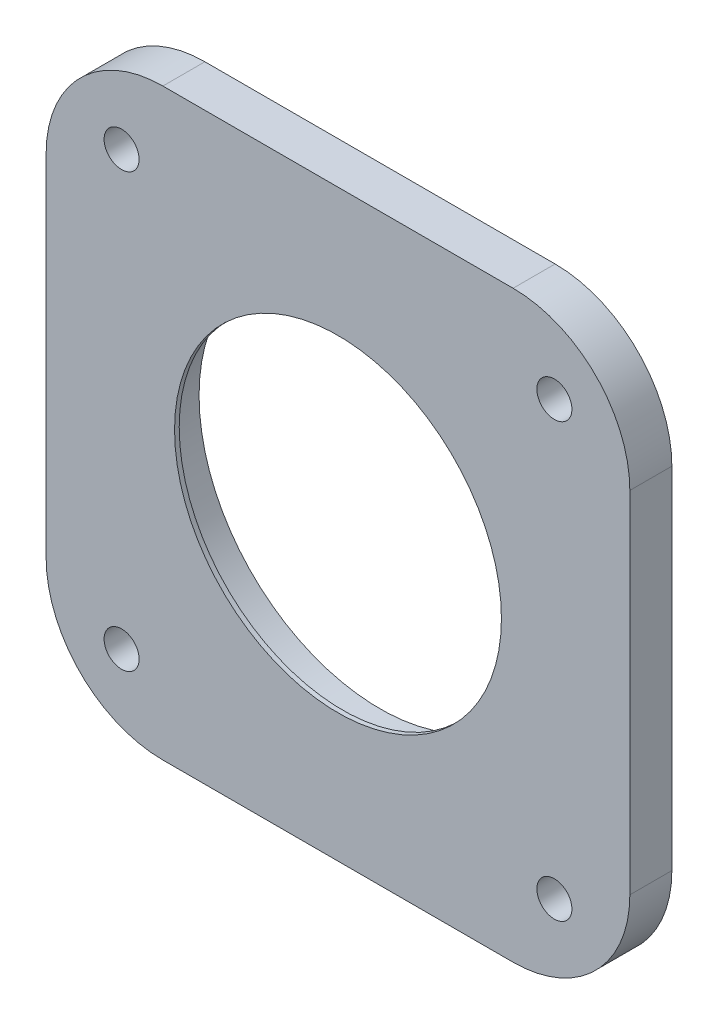
ISO-10303-21;
HEADER;
FILE_DESCRIPTION(('STEP AP214'),'2;1');
FILE_NAME('part.step','',(''),(''),'','','');
FILE_SCHEMA(('AUTOMOTIVE_DESIGN { 1 0 10303 214 1 1 1 1 }'));
ENDSEC;
DATA;
#1=APPLICATION_CONTEXT('core data for automotive mechanical design processes');
#2=APPLICATION_PROTOCOL_DEFINITION('international standard','automotive_design',2000,#1);
#3=PRODUCT_CONTEXT('',#1,'mechanical');
#4=PRODUCT('Part','Part','',(#3));
#5=PRODUCT_RELATED_PRODUCT_CATEGORY('part','',(#4));
#6=PRODUCT_DEFINITION_FORMATION('','',#4);
#7=PRODUCT_DEFINITION_CONTEXT('part definition',#1,'design');
#8=PRODUCT_DEFINITION('design','',#6,#7);
#9=PRODUCT_DEFINITION_SHAPE('','',#8);
#10=(LENGTH_UNIT() NAMED_UNIT(*) SI_UNIT(.MILLI.,.METRE.));
#11=(NAMED_UNIT(*) PLANE_ANGLE_UNIT() SI_UNIT($,.RADIAN.));
#12=(NAMED_UNIT(*) SI_UNIT($,.STERADIAN.) SOLID_ANGLE_UNIT());
#13=UNCERTAINTY_MEASURE_WITH_UNIT(LENGTH_MEASURE(1.E-05),#10,'distance_accuracy_value','');
#14=(GEOMETRIC_REPRESENTATION_CONTEXT(3) GLOBAL_UNCERTAINTY_ASSIGNED_CONTEXT((#13)) GLOBAL_UNIT_ASSIGNED_CONTEXT((#10,
#11,#12)) REPRESENTATION_CONTEXT('',''));
#15=CARTESIAN_POINT('',(0.,0.,0.));
#16=DIRECTION('',(0.,0.,1.));
#17=DIRECTION('',(1.,0.,0.));
#18=AXIS2_PLACEMENT_3D('',#15,#16,#17);
#19=CARTESIAN_POINT('',(0.,0.,4.572));
#20=DIRECTION('',(0.,0.,-1.));
#21=DIRECTION('',(-1.,0.,0.));
#22=AXIS2_PLACEMENT_3D('',#19,#20,#21);
#23=CYLINDRICAL_SURFACE('',#22,19.685);
#24=CARTESIAN_POINT('',(0.,0.,0.));
#25=DIRECTION('',(0.,0.,1.));
#26=DIRECTION('',(1.,0.,0.));
#27=AXIS2_PLACEMENT_3D('',#24,#25,#26);
#28=CIRCLE('',#27,19.685);
#29=CARTESIAN_POINT('',(19.685,0.,0.));
#30=VERTEX_POINT('',#29);
#31=EDGE_CURVE('E153',#30,#30,#28,.T.);
#32=ORIENTED_EDGE('',*,*,#31,.F.);
#33=EDGE_LOOP('',(#32));
#34=FACE_BOUND('',#33,.T.);
#35=CARTESIAN_POINT('',(0.,0.,4.064));
#36=DIRECTION('',(0.,0.,1.));
#37=DIRECTION('',(1.,0.,0.));
#38=AXIS2_PLACEMENT_3D('',#35,#36,#37);
#39=CIRCLE('',#38,19.685);
#40=CARTESIAN_POINT('',(19.685,0.,4.064));
#41=VERTEX_POINT('',#40);
#42=EDGE_CURVE('E248',#41,#41,#39,.T.);
#43=ORIENTED_EDGE('',*,*,#42,.T.);
#44=EDGE_LOOP('',(#43));
#45=FACE_BOUND('',#44,.T.);
#46=ADVANCED_FACE('F45',(#34,#45),#23,.F.);
#47=CARTESIAN_POINT('',(-19.05,-19.05,4.572));
#48=DIRECTION('',(0.,0.,-1.));
#49=DIRECTION('',(-1.,0.,0.));
#50=AXIS2_PLACEMENT_3D('',#47,#48,#49);
#51=PLANE('',#50);
#52=CARTESIAN_POINT('',(-19.05,-19.05,4.572));
#53=DIRECTION('',(0.,0.,1.));
#54=DIRECTION('',(-1.,0.,0.));
#55=AXIS2_PLACEMENT_3D('',#52,#53,#54);
#56=CIRCLE('',#55,12.7);
#57=CARTESIAN_POINT('',(-31.75,-19.0499999999999,4.572));
#58=VERTEX_POINT('',#57);
#59=CARTESIAN_POINT('',(-19.0499999999999,-31.75,4.572));
#60=VERTEX_POINT('',#59);
#61=EDGE_CURVE('E171',#58,#60,#56,.T.);
#62=ORIENTED_EDGE('',*,*,#61,.T.);
#63=DIRECTION('',(1.,0.,0.));
#64=VECTOR('',#63,1.);
#65=CARTESIAN_POINT('',(-19.0499999999999,-31.75,4.572));
#66=LINE('',#65,#64);
#67=CARTESIAN_POINT('',(19.0499999999999,-31.75,4.572));
#68=VERTEX_POINT('',#67);
#69=EDGE_CURVE('E106',#60,#68,#66,.T.);
#70=ORIENTED_EDGE('',*,*,#69,.T.);
#71=CARTESIAN_POINT('',(19.05,-19.05,4.572));
#72=DIRECTION('',(0.,0.,1.));
#73=DIRECTION('',(1.,0.,0.));
#74=AXIS2_PLACEMENT_3D('',#71,#72,#73);
#75=CIRCLE('',#74,12.7);
#76=CARTESIAN_POINT('',(31.75,-19.05,4.572));
#77=VERTEX_POINT('',#76);
#78=EDGE_CURVE('E192',#68,#77,#75,.T.);
#79=ORIENTED_EDGE('',*,*,#78,.T.);
#80=DIRECTION('',(0.,1.,0.));
#81=VECTOR('',#80,1.);
#82=CARTESIAN_POINT('',(31.75,-19.0499999999999,4.572));
#83=LINE('',#82,#81);
#84=CARTESIAN_POINT('',(31.75,19.0499999999999,4.572));
#85=VERTEX_POINT('',#84);
#86=EDGE_CURVE('E206',#77,#85,#83,.T.);
#87=ORIENTED_EDGE('',*,*,#86,.T.);
#88=CARTESIAN_POINT('',(19.05,19.05,4.572));
#89=DIRECTION('',(0.,0.,1.));
#90=DIRECTION('',(-1.,0.,0.));
#91=AXIS2_PLACEMENT_3D('',#88,#89,#90);
#92=CIRCLE('',#91,12.7);
#93=CARTESIAN_POINT('',(19.0499999999999,31.75,4.572));
#94=VERTEX_POINT('',#93);
#95=EDGE_CURVE('E126',#85,#94,#92,.T.);
#96=ORIENTED_EDGE('',*,*,#95,.T.);
#97=DIRECTION('',(-1.,0.,0.));
#98=VECTOR('',#97,1.);
#99=CARTESIAN_POINT('',(-19.0499999999999,31.75,4.572));
#100=LINE('',#99,#98);
#101=CARTESIAN_POINT('',(-19.0499999999999,31.75,4.572));
#102=VERTEX_POINT('',#101);
#103=EDGE_CURVE('E119',#94,#102,#100,.T.);
#104=ORIENTED_EDGE('',*,*,#103,.T.);
#105=CARTESIAN_POINT('',(-19.05,19.05,4.572));
#106=DIRECTION('',(0.,0.,1.));
#107=DIRECTION('',(-1.,0.,0.));
#108=AXIS2_PLACEMENT_3D('',#105,#106,#107);
#109=CIRCLE('',#108,12.7);
#110=CARTESIAN_POINT('',(-31.75,19.0499999999999,4.572));
#111=VERTEX_POINT('',#110);
#112=EDGE_CURVE('E124',#102,#111,#109,.T.);
#113=ORIENTED_EDGE('',*,*,#112,.T.);
#114=DIRECTION('',(0.,-1.,0.));
#115=VECTOR('',#114,1.);
#116=CARTESIAN_POINT('',(-31.75,-19.0499999999999,4.572));
#117=LINE('',#116,#115);
#118=EDGE_CURVE('E63',#111,#58,#117,.T.);
#119=ORIENTED_EDGE('',*,*,#118,.T.);
#120=EDGE_LOOP('',(#62,#70,#79,#87,#96,#104,#113,#119));
#121=FACE_BOUND('',#120,.T.);
#122=CARTESIAN_POINT('',(-23.5401280605346,23.5401280605346,4.572));
#123=DIRECTION('',(0.,0.,1.));
#124=DIRECTION('',(1.,0.,0.));
#125=AXIS2_PLACEMENT_3D('',#122,#123,#124);
#126=CIRCLE('',#125,1.905);
#127=CARTESIAN_POINT('',(-21.6351280605346,23.5401280605346,4.572));
#128=VERTEX_POINT('',#127);
#129=EDGE_CURVE('E219',#128,#128,#126,.T.);
#130=ORIENTED_EDGE('',*,*,#129,.F.);
#131=EDGE_LOOP('',(#130));
#132=FACE_BOUND('',#131,.T.);
#133=CARTESIAN_POINT('',(23.5401280605347,23.5401280605345,4.572));
#134=DIRECTION('',(0.,0.,1.));
#135=DIRECTION('',(1.,0.,0.));
#136=AXIS2_PLACEMENT_3D('',#133,#134,#135);
#137=CIRCLE('',#136,1.905);
#138=CARTESIAN_POINT('',(25.4451280605347,23.5401280605345,4.572));
#139=VERTEX_POINT('',#138);
#140=EDGE_CURVE('E224',#139,#139,#137,.T.);
#141=ORIENTED_EDGE('',*,*,#140,.F.);
#142=EDGE_LOOP('',(#141));
#143=FACE_BOUND('',#142,.T.);
#144=CARTESIAN_POINT('',(23.5401280605344,-23.5401280605347,4.572));
#145=DIRECTION('',(0.,0.,1.));
#146=DIRECTION('',(1.,0.,0.));
#147=AXIS2_PLACEMENT_3D('',#144,#145,#146);
#148=CIRCLE('',#147,1.905);
#149=CARTESIAN_POINT('',(25.4451280605344,-23.5401280605347,4.572));
#150=VERTEX_POINT('',#149);
#151=EDGE_CURVE('E232',#150,#150,#148,.T.);
#152=ORIENTED_EDGE('',*,*,#151,.F.);
#153=EDGE_LOOP('',(#152));
#154=FACE_BOUND('',#153,.T.);
#155=CARTESIAN_POINT('',(-23.5401280605348,-23.5401280605343,4.572));
#156=DIRECTION('',(0.,0.,1.));
#157=DIRECTION('',(1.,0.,0.));
#158=AXIS2_PLACEMENT_3D('',#155,#156,#157);
#159=CIRCLE('',#158,1.905);
#160=CARTESIAN_POINT('',(-21.6351280605348,-23.5401280605343,4.572));
#161=VERTEX_POINT('',#160);
#162=EDGE_CURVE('E240',#161,#161,#159,.T.);
#163=ORIENTED_EDGE('',*,*,#162,.F.);
#164=EDGE_LOOP('',(#163));
#165=FACE_BOUND('',#164,.T.);
#166=CARTESIAN_POINT('',(0.,0.,4.572));
#167=DIRECTION('',(0.,0.,1.));
#168=DIRECTION('',(1.,0.,0.));
#169=AXIS2_PLACEMENT_3D('',#166,#167,#168);
#170=CIRCLE('',#169,17.78);
#171=CARTESIAN_POINT('',(17.78,0.,4.572));
#172=VERTEX_POINT('',#171);
#173=EDGE_CURVE('E256',#172,#172,#170,.T.);
#174=ORIENTED_EDGE('',*,*,#173,.F.);
#175=EDGE_LOOP('',(#174));
#176=FACE_BOUND('',#175,.T.);
#177=ADVANCED_FACE('F121',(#121,#132,#143,#154,#165,#176),#51,.F.);
#178=CARTESIAN_POINT('',(-19.05,-19.05,0.));
#179=DIRECTION('',(0.,0.,-1.));
#180=DIRECTION('',(-1.,0.,0.));
#181=AXIS2_PLACEMENT_3D('',#178,#179,#180);
#182=PLANE('',#181);
#183=CARTESIAN_POINT('',(23.5401280605344,-23.5401280605347,0.));
#184=DIRECTION('',(0.,0.,1.));
#185=DIRECTION('',(1.,0.,0.));
#186=AXIS2_PLACEMENT_3D('',#183,#184,#185);
#187=CIRCLE('',#186,1.905);
#188=CARTESIAN_POINT('',(25.4451280605344,-23.5401280605347,0.));
#189=VERTEX_POINT('',#188);
#190=EDGE_CURVE('E236',#189,#189,#187,.T.);
#191=ORIENTED_EDGE('',*,*,#190,.T.);
#192=EDGE_LOOP('',(#191));
#193=FACE_BOUND('',#192,.T.);
#194=CARTESIAN_POINT('',(-23.5401280605346,23.5401280605346,0.));
#195=DIRECTION('',(0.,0.,1.));
#196=DIRECTION('',(1.,0.,0.));
#197=AXIS2_PLACEMENT_3D('',#194,#195,#196);
#198=CIRCLE('',#197,1.905);
#199=CARTESIAN_POINT('',(-21.6351280605346,23.5401280605346,0.));
#200=VERTEX_POINT('',#199);
#201=EDGE_CURVE('E220',#200,#200,#198,.T.);
#202=ORIENTED_EDGE('',*,*,#201,.T.);
#203=EDGE_LOOP('',(#202));
#204=FACE_BOUND('',#203,.T.);
#205=CARTESIAN_POINT('',(-19.05,-19.05,0.));
#206=DIRECTION('',(0.,0.,1.));
#207=DIRECTION('',(-1.,0.,0.));
#208=AXIS2_PLACEMENT_3D('',#205,#206,#207);
#209=CIRCLE('',#208,12.7);
#210=CARTESIAN_POINT('',(-31.75,-19.0499999999999,0.));
#211=VERTEX_POINT('',#210);
#212=CARTESIAN_POINT('',(-19.0499999999999,-31.75,0.));
#213=VERTEX_POINT('',#212);
#214=EDGE_CURVE('E148',#211,#213,#209,.T.);
#215=ORIENTED_EDGE('',*,*,#214,.F.);
#216=DIRECTION('',(0.,-1.,0.));
#217=VECTOR('',#216,1.);
#218=CARTESIAN_POINT('',(-31.75,-19.0499999999999,0.));
#219=LINE('',#218,#217);
#220=CARTESIAN_POINT('',(-31.75,19.0499999999999,0.));
#221=VERTEX_POINT('',#220);
#222=EDGE_CURVE('E98',#221,#211,#219,.T.);
#223=ORIENTED_EDGE('',*,*,#222,.F.);
#224=CARTESIAN_POINT('',(-19.05,19.05,0.));
#225=DIRECTION('',(0.,0.,1.));
#226=DIRECTION('',(-1.,0.,0.));
#227=AXIS2_PLACEMENT_3D('',#224,#225,#226);
#228=CIRCLE('',#227,12.7);
#229=CARTESIAN_POINT('',(-19.0499999999999,31.75,0.));
#230=VERTEX_POINT('',#229);
#231=EDGE_CURVE('E92',#230,#221,#228,.T.);
#232=ORIENTED_EDGE('',*,*,#231,.F.);
#233=DIRECTION('',(-1.,0.,0.));
#234=VECTOR('',#233,1.);
#235=CARTESIAN_POINT('',(-19.0499999999999,31.75,0.));
#236=LINE('',#235,#234);
#237=CARTESIAN_POINT('',(19.0499999999999,31.75,0.));
#238=VERTEX_POINT('',#237);
#239=EDGE_CURVE('E135',#238,#230,#236,.T.);
#240=ORIENTED_EDGE('',*,*,#239,.F.);
#241=CARTESIAN_POINT('',(19.05,19.05,0.));
#242=DIRECTION('',(0.,0.,1.));
#243=DIRECTION('',(-1.,0.,0.));
#244=AXIS2_PLACEMENT_3D('',#241,#242,#243);
#245=CIRCLE('',#244,12.7);
#246=CARTESIAN_POINT('',(31.75,19.0499999999999,0.));
#247=VERTEX_POINT('',#246);
#248=EDGE_CURVE('E162',#247,#238,#245,.T.);
#249=ORIENTED_EDGE('',*,*,#248,.F.);
#250=DIRECTION('',(0.,1.,0.));
#251=VECTOR('',#250,1.);
#252=CARTESIAN_POINT('',(31.75,-19.0499999999999,0.));
#253=LINE('',#252,#251);
#254=CARTESIAN_POINT('',(31.75,-19.05,0.));
#255=VERTEX_POINT('',#254);
#256=EDGE_CURVE('E159',#255,#247,#253,.T.);
#257=ORIENTED_EDGE('',*,*,#256,.F.);
#258=CARTESIAN_POINT('',(19.05,-19.05,0.));
#259=DIRECTION('',(0.,0.,1.));
#260=DIRECTION('',(1.,0.,0.));
#261=AXIS2_PLACEMENT_3D('',#258,#259,#260);
#262=CIRCLE('',#261,12.7);
#263=CARTESIAN_POINT('',(19.0499999999999,-31.75,0.));
#264=VERTEX_POINT('',#263);
#265=EDGE_CURVE('E156',#264,#255,#262,.T.);
#266=ORIENTED_EDGE('',*,*,#265,.F.);
#267=DIRECTION('',(1.,0.,0.));
#268=VECTOR('',#267,1.);
#269=CARTESIAN_POINT('',(-19.0499999999999,-31.75,0.));
#270=LINE('',#269,#268);
#271=EDGE_CURVE('E152',#213,#264,#270,.T.);
#272=ORIENTED_EDGE('',*,*,#271,.F.);
#273=EDGE_LOOP('',(#215,#223,#232,#240,#249,#257,#266,#272));
#274=FACE_BOUND('',#273,.T.);
#275=ORIENTED_EDGE('',*,*,#31,.T.);
#276=EDGE_LOOP('',(#275));
#277=FACE_BOUND('',#276,.T.);
#278=CARTESIAN_POINT('',(23.5401280605347,23.5401280605345,0.));
#279=DIRECTION('',(0.,0.,1.));
#280=DIRECTION('',(1.,0.,0.));
#281=AXIS2_PLACEMENT_3D('',#278,#279,#280);
#282=CIRCLE('',#281,1.905);
#283=CARTESIAN_POINT('',(25.4451280605347,23.5401280605345,0.));
#284=VERTEX_POINT('',#283);
#285=EDGE_CURVE('E228',#284,#284,#282,.T.);
#286=ORIENTED_EDGE('',*,*,#285,.T.);
#287=EDGE_LOOP('',(#286));
#288=FACE_BOUND('',#287,.T.);
#289=CARTESIAN_POINT('',(-23.5401280605348,-23.5401280605343,0.));
#290=DIRECTION('',(0.,0.,1.));
#291=DIRECTION('',(1.,0.,0.));
#292=AXIS2_PLACEMENT_3D('',#289,#290,#291);
#293=CIRCLE('',#292,1.905);
#294=CARTESIAN_POINT('',(-21.6351280605348,-23.5401280605343,0.));
#295=VERTEX_POINT('',#294);
#296=EDGE_CURVE('E244',#295,#295,#293,.T.);
#297=ORIENTED_EDGE('',*,*,#296,.T.);
#298=EDGE_LOOP('',(#297));
#299=FACE_BOUND('',#298,.T.);
#300=ADVANCED_FACE('F196',(#193,#204,#274,#277,#288,#299),#182,.T.);
#301=CARTESIAN_POINT('',(-19.05,-19.05,4.572));
#302=DIRECTION('',(0.,0.,-1.));
#303=DIRECTION('',(-1.,0.,0.));
#304=AXIS2_PLACEMENT_3D('',#301,#302,#303);
#305=CYLINDRICAL_SURFACE('',#304,12.7);
#306=ORIENTED_EDGE('',*,*,#214,.T.);
#307=DIRECTION('',(0.,0.,-1.));
#308=VECTOR('',#307,1.);
#309=CARTESIAN_POINT('',(-19.0499999999999,-31.75,4.572));
#310=LINE('',#309,#308);
#311=EDGE_CURVE('E11',#60,#213,#310,.T.);
#312=ORIENTED_EDGE('',*,*,#311,.F.);
#313=ORIENTED_EDGE('',*,*,#61,.F.);
#314=DIRECTION('',(0.,0.,-1.));
#315=VECTOR('',#314,1.);
#316=CARTESIAN_POINT('',(-31.75,-19.0499999999999,4.572));
#317=LINE('',#316,#315);
#318=EDGE_CURVE('E144',#58,#211,#317,.T.);
#319=ORIENTED_EDGE('',*,*,#318,.T.);
#320=EDGE_LOOP('',(#306,#312,#313,#319));
#321=FACE_BOUND('',#320,.T.);
#322=ADVANCED_FACE('F47',(#321),#305,.T.);
#323=CARTESIAN_POINT('',(-19.0499999999999,-31.75,4.572));
#324=DIRECTION('',(0.,1.,0.));
#325=DIRECTION('',(-1.,0.,0.));
#326=AXIS2_PLACEMENT_3D('',#323,#324,#325);
#327=PLANE('',#326);
#328=ORIENTED_EDGE('',*,*,#271,.T.);
#329=DIRECTION('',(0.,0.,-1.));
#330=VECTOR('',#329,1.);
#331=CARTESIAN_POINT('',(19.0499999999999,-31.75,4.572));
#332=LINE('',#331,#330);
#333=EDGE_CURVE('E55',#68,#264,#332,.T.);
#334=ORIENTED_EDGE('',*,*,#333,.F.);
#335=ORIENTED_EDGE('',*,*,#69,.F.);
#336=ORIENTED_EDGE('',*,*,#311,.T.);
#337=EDGE_LOOP('',(#328,#334,#335,#336));
#338=FACE_BOUND('',#337,.T.);
#339=ADVANCED_FACE('F299',(#338),#327,.F.);
#340=CARTESIAN_POINT('',(19.05,-19.05,4.572));
#341=DIRECTION('',(0.,0.,-1.));
#342=DIRECTION('',(-1.,0.,0.));
#343=AXIS2_PLACEMENT_3D('',#340,#341,#342);
#344=CYLINDRICAL_SURFACE('',#343,12.7);
#345=ORIENTED_EDGE('',*,*,#265,.T.);
#346=DIRECTION('',(0.,0.,-1.));
#347=VECTOR('',#346,1.);
#348=CARTESIAN_POINT('',(31.75,-19.05,4.572));
#349=LINE('',#348,#347);
#350=EDGE_CURVE('E182',#77,#255,#349,.T.);
#351=ORIENTED_EDGE('',*,*,#350,.F.);
#352=ORIENTED_EDGE('',*,*,#78,.F.);
#353=ORIENTED_EDGE('',*,*,#333,.T.);
#354=EDGE_LOOP('',(#345,#351,#352,#353));
#355=FACE_BOUND('',#354,.T.);
#356=ADVANCED_FACE('F190',(#355),#344,.T.);
#357=CARTESIAN_POINT('',(31.75,-19.0499999999999,4.572));
#358=DIRECTION('',(-1.,0.,0.));
#359=DIRECTION('',(0.,0.,1.));
#360=AXIS2_PLACEMENT_3D('',#357,#358,#359);
#361=PLANE('',#360);
#362=ORIENTED_EDGE('',*,*,#256,.T.);
#363=DIRECTION('',(0.,0.,-1.));
#364=VECTOR('',#363,1.);
#365=CARTESIAN_POINT('',(31.75,19.0499999999999,4.572));
#366=LINE('',#365,#364);
#367=EDGE_CURVE('E178',#85,#247,#366,.T.);
#368=ORIENTED_EDGE('',*,*,#367,.F.);
#369=ORIENTED_EDGE('',*,*,#86,.F.);
#370=ORIENTED_EDGE('',*,*,#350,.T.);
#371=EDGE_LOOP('',(#362,#368,#369,#370));
#372=FACE_BOUND('',#371,.T.);
#373=ADVANCED_FACE('F201',(#372),#361,.F.);
#374=CARTESIAN_POINT('',(19.05,19.05,4.572));
#375=DIRECTION('',(0.,0.,-1.));
#376=DIRECTION('',(-1.,0.,0.));
#377=AXIS2_PLACEMENT_3D('',#374,#375,#376);
#378=CYLINDRICAL_SURFACE('',#377,12.7);
#379=ORIENTED_EDGE('',*,*,#248,.T.);
#380=DIRECTION('',(0.,0.,-1.));
#381=VECTOR('',#380,1.);
#382=CARTESIAN_POINT('',(19.0499999999999,31.75,4.572));
#383=LINE('',#382,#381);
#384=EDGE_CURVE('E137',#94,#238,#383,.T.);
#385=ORIENTED_EDGE('',*,*,#384,.F.);
#386=ORIENTED_EDGE('',*,*,#95,.F.);
#387=ORIENTED_EDGE('',*,*,#367,.T.);
#388=EDGE_LOOP('',(#379,#385,#386,#387));
#389=FACE_BOUND('',#388,.T.);
#390=ADVANCED_FACE('F204',(#389),#378,.T.);
#391=CARTESIAN_POINT('',(-19.0499999999999,31.75,4.572));
#392=DIRECTION('',(0.,-1.,0.));
#393=DIRECTION('',(0.,0.,-1.));
#394=AXIS2_PLACEMENT_3D('',#391,#392,#393);
#395=PLANE('',#394);
#396=ORIENTED_EDGE('',*,*,#239,.T.);
#397=DIRECTION('',(0.,0.,-1.));
#398=VECTOR('',#397,1.);
#399=CARTESIAN_POINT('',(-19.0499999999999,31.75,4.572));
#400=LINE('',#399,#398);
#401=EDGE_CURVE('E132',#102,#230,#400,.T.);
#402=ORIENTED_EDGE('',*,*,#401,.F.);
#403=ORIENTED_EDGE('',*,*,#103,.F.);
#404=ORIENTED_EDGE('',*,*,#384,.T.);
#405=EDGE_LOOP('',(#396,#402,#403,#404));
#406=FACE_BOUND('',#405,.T.);
#407=ADVANCED_FACE('F133',(#406),#395,.F.);
#408=CARTESIAN_POINT('',(-19.05,19.05,4.572));
#409=DIRECTION('',(0.,0.,-1.));
#410=DIRECTION('',(-1.,0.,0.));
#411=AXIS2_PLACEMENT_3D('',#408,#409,#410);
#412=CYLINDRICAL_SURFACE('',#411,12.7);
#413=ORIENTED_EDGE('',*,*,#231,.T.);
#414=DIRECTION('',(0.,0.,-1.));
#415=VECTOR('',#414,1.);
#416=CARTESIAN_POINT('',(-31.75,19.0499999999999,4.572));
#417=LINE('',#416,#415);
#418=EDGE_CURVE('E138',#111,#221,#417,.T.);
#419=ORIENTED_EDGE('',*,*,#418,.F.);
#420=ORIENTED_EDGE('',*,*,#112,.F.);
#421=ORIENTED_EDGE('',*,*,#401,.T.);
#422=EDGE_LOOP('',(#413,#419,#420,#421));
#423=FACE_BOUND('',#422,.T.);
#424=ADVANCED_FACE('F140',(#423),#412,.T.);
#425=CARTESIAN_POINT('',(-31.75,-19.0499999999999,4.572));
#426=DIRECTION('',(1.,0.,0.));
#427=DIRECTION('',(0.,0.,-1.));
#428=AXIS2_PLACEMENT_3D('',#425,#426,#427);
#429=PLANE('',#428);
#430=ORIENTED_EDGE('',*,*,#222,.T.);
#431=ORIENTED_EDGE('',*,*,#318,.F.);
#432=ORIENTED_EDGE('',*,*,#118,.F.);
#433=ORIENTED_EDGE('',*,*,#418,.T.);
#434=EDGE_LOOP('',(#430,#431,#432,#433));
#435=FACE_BOUND('',#434,.T.);
#436=ADVANCED_FACE('F286',(#435),#429,.F.);
#437=CARTESIAN_POINT('',(-23.5401280605346,23.5401280605346,4.572));
#438=DIRECTION('',(0.,0.,-1.));
#439=DIRECTION('',(-1.,0.,0.));
#440=AXIS2_PLACEMENT_3D('',#437,#438,#439);
#441=CYLINDRICAL_SURFACE('',#440,1.905);
#442=ORIENTED_EDGE('',*,*,#129,.T.);
#443=EDGE_LOOP('',(#442));
#444=FACE_BOUND('',#443,.T.);
#445=ORIENTED_EDGE('',*,*,#201,.F.);
#446=EDGE_LOOP('',(#445));
#447=FACE_BOUND('',#446,.T.);
#448=ADVANCED_FACE('F289',(#444,#447),#441,.F.);
#449=CARTESIAN_POINT('',(23.5401280605347,23.5401280605345,4.572));
#450=DIRECTION('',(0.,0.,-1.));
#451=DIRECTION('',(-1.,0.,0.));
#452=AXIS2_PLACEMENT_3D('',#449,#450,#451);
#453=CYLINDRICAL_SURFACE('',#452,1.905);
#454=ORIENTED_EDGE('',*,*,#140,.T.);
#455=EDGE_LOOP('',(#454));
#456=FACE_BOUND('',#455,.T.);
#457=ORIENTED_EDGE('',*,*,#285,.F.);
#458=EDGE_LOOP('',(#457));
#459=FACE_BOUND('',#458,.T.);
#460=ADVANCED_FACE('F359',(#456,#459),#453,.F.);
#461=CARTESIAN_POINT('',(23.5401280605344,-23.5401280605347,4.572));
#462=DIRECTION('',(0.,0.,-1.));
#463=DIRECTION('',(-1.,0.,0.));
#464=AXIS2_PLACEMENT_3D('',#461,#462,#463);
#465=CYLINDRICAL_SURFACE('',#464,1.905);
#466=ORIENTED_EDGE('',*,*,#151,.T.);
#467=EDGE_LOOP('',(#466));
#468=FACE_BOUND('',#467,.T.);
#469=ORIENTED_EDGE('',*,*,#190,.F.);
#470=EDGE_LOOP('',(#469));
#471=FACE_BOUND('',#470,.T.);
#472=ADVANCED_FACE('F350',(#468,#471),#465,.F.);
#473=CARTESIAN_POINT('',(-23.5401280605348,-23.5401280605343,4.572));
#474=DIRECTION('',(0.,0.,-1.));
#475=DIRECTION('',(-1.,0.,0.));
#476=AXIS2_PLACEMENT_3D('',#473,#474,#475);
#477=CYLINDRICAL_SURFACE('',#476,1.905);
#478=ORIENTED_EDGE('',*,*,#162,.T.);
#479=EDGE_LOOP('',(#478));
#480=FACE_BOUND('',#479,.T.);
#481=ORIENTED_EDGE('',*,*,#296,.F.);
#482=EDGE_LOOP('',(#481));
#483=FACE_BOUND('',#482,.T.);
#484=ADVANCED_FACE('F335',(#480,#483),#477,.F.);
#485=CARTESIAN_POINT('',(0.,0.,4.064));
#486=DIRECTION('',(0.,0.,1.));
#487=DIRECTION('',(1.,0.,0.));
#488=AXIS2_PLACEMENT_3D('',#485,#486,#487);
#489=PLANE('',#488);
#490=CARTESIAN_POINT('',(0.,0.,4.064));
#491=DIRECTION('',(0.,0.,1.));
#492=DIRECTION('',(1.,0.,0.));
#493=AXIS2_PLACEMENT_3D('',#490,#491,#492);
#494=CIRCLE('',#493,17.78);
#495=CARTESIAN_POINT('',(17.78,0.,4.064));
#496=VERTEX_POINT('',#495);
#497=EDGE_CURVE('E255',#496,#496,#494,.T.);
#498=ORIENTED_EDGE('',*,*,#497,.T.);
#499=EDGE_LOOP('',(#498));
#500=FACE_BOUND('',#499,.T.);
#501=ORIENTED_EDGE('',*,*,#42,.F.);
#502=EDGE_LOOP('',(#501));
#503=FACE_BOUND('',#502,.T.);
#504=ADVANCED_FACE('F264',(#500,#503),#489,.F.);
#505=CARTESIAN_POINT('',(0.,0.,4.064));
#506=DIRECTION('',(0.,0.,1.));
#507=DIRECTION('',(1.,0.,0.));
#508=AXIS2_PLACEMENT_3D('',#505,#506,#507);
#509=CYLINDRICAL_SURFACE('',#508,17.78);
#510=ORIENTED_EDGE('',*,*,#497,.F.);
#511=EDGE_LOOP('',(#510));
#512=FACE_BOUND('',#511,.T.);
#513=ORIENTED_EDGE('',*,*,#173,.T.);
#514=EDGE_LOOP('',(#513));
#515=FACE_BOUND('',#514,.T.);
#516=ADVANCED_FACE('F267',(#512,#515),#509,.F.);
#517=CLOSED_SHELL('',(#46,#177,#300,#322,#339,#356,#373,#390,#407,#424,#436,#448,#460,#472,#484,
#504,#516));
#518=MANIFOLD_SOLID_BREP('B2',#517);
#519=ADVANCED_BREP_SHAPE_REPRESENTATION('',(#18,#518),#14);
#520=SHAPE_DEFINITION_REPRESENTATION(#9,#519);
ENDSEC;
END-ISO-10303-21;
